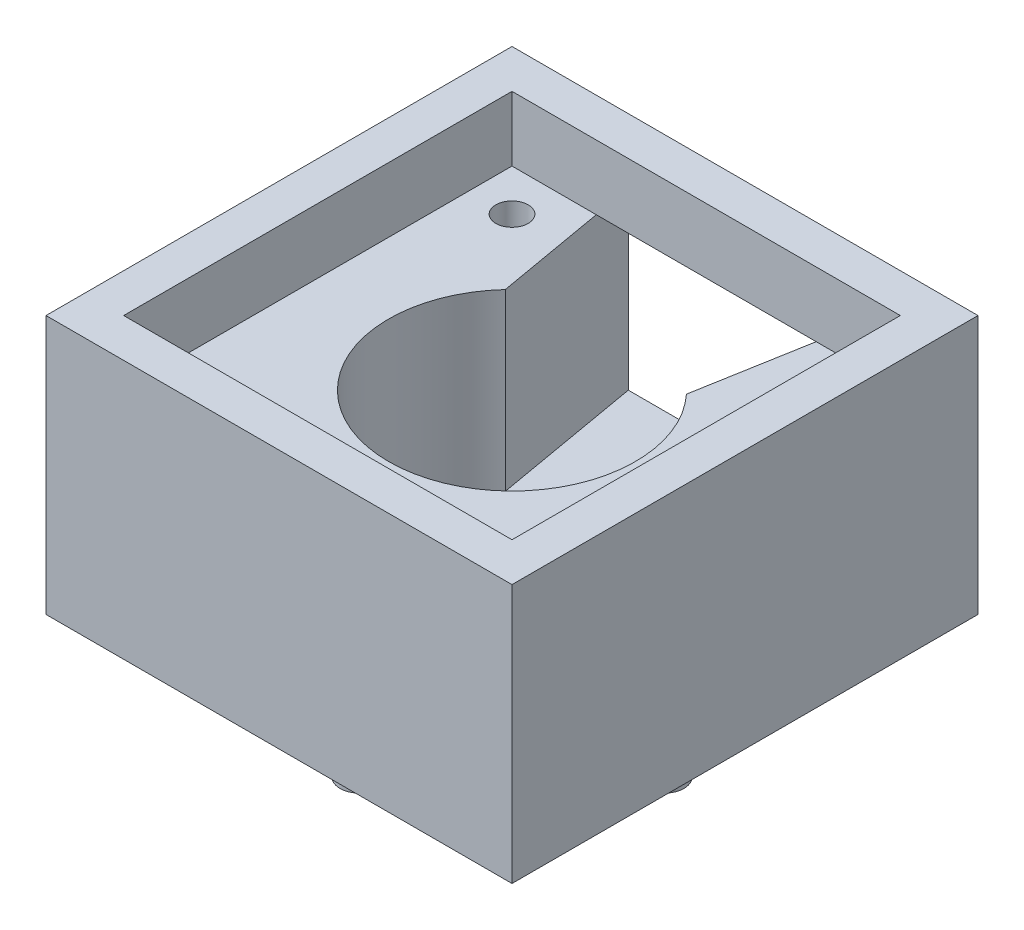
ISO-10303-21;
HEADER;
FILE_DESCRIPTION(('STEP AP214'),'2;1');
FILE_NAME('part.step','',(''),(''),'','','');
FILE_SCHEMA(('AUTOMOTIVE_DESIGN { 1 0 10303 214 1 1 1 1 }'));
ENDSEC;
DATA;
#1=APPLICATION_CONTEXT('core data for automotive mechanical design processes');
#2=APPLICATION_PROTOCOL_DEFINITION('international standard','automotive_design',2000,#1);
#3=PRODUCT_CONTEXT('',#1,'mechanical');
#4=PRODUCT('Part','Part','',(#3));
#5=PRODUCT_RELATED_PRODUCT_CATEGORY('part','',(#4));
#6=PRODUCT_DEFINITION_FORMATION('','',#4);
#7=PRODUCT_DEFINITION_CONTEXT('part definition',#1,'design');
#8=PRODUCT_DEFINITION('design','',#6,#7);
#9=PRODUCT_DEFINITION_SHAPE('','',#8);
#10=(LENGTH_UNIT() NAMED_UNIT(*) SI_UNIT(.MILLI.,.METRE.));
#11=(NAMED_UNIT(*) PLANE_ANGLE_UNIT() SI_UNIT($,.RADIAN.));
#12=(NAMED_UNIT(*) SI_UNIT($,.STERADIAN.) SOLID_ANGLE_UNIT());
#13=UNCERTAINTY_MEASURE_WITH_UNIT(LENGTH_MEASURE(1.E-05),#10,'distance_accuracy_value','');
#14=(GEOMETRIC_REPRESENTATION_CONTEXT(3) GLOBAL_UNCERTAINTY_ASSIGNED_CONTEXT((#13)) GLOBAL_UNIT_ASSIGNED_CONTEXT((#10,
#11,#12)) REPRESENTATION_CONTEXT('',''));
#15=CARTESIAN_POINT('',(0.,0.,0.));
#16=DIRECTION('',(0.,0.,1.));
#17=DIRECTION('',(1.,0.,0.));
#18=AXIS2_PLACEMENT_3D('',#15,#16,#17);
#19=CARTESIAN_POINT('',(0.,30.,0.));
#20=DIRECTION('',(0.,1.,0.));
#21=DIRECTION('',(0.,0.,1.));
#22=AXIS2_PLACEMENT_3D('',#19,#20,#21);
#23=PLANE('',#22);
#24=CARTESIAN_POINT('',(-23.57,30.,23.57));
#25=DIRECTION('',(0.,1.,0.));
#26=DIRECTION('',(0.,0.,1.));
#27=AXIS2_PLACEMENT_3D('',#24,#25,#26);
#28=CIRCLE('',#27,2.5);
#29=CARTESIAN_POINT('',(-23.57,30.,26.07));
#30=VERTEX_POINT('',#29);
#31=EDGE_CURVE('E169',#30,#30,#28,.T.);
#32=ORIENTED_EDGE('',*,*,#31,.F.);
#33=EDGE_LOOP('',(#32));
#34=FACE_BOUND('',#33,.T.);
#35=CARTESIAN_POINT('',(23.57,30.,-23.57));
#36=DIRECTION('',(0.,1.,0.));
#37=DIRECTION('',(0.,0.,1.));
#38=AXIS2_PLACEMENT_3D('',#35,#36,#37);
#39=CIRCLE('',#38,2.5);
#40=CARTESIAN_POINT('',(23.57,30.,-21.07));
#41=VERTEX_POINT('',#40);
#42=EDGE_CURVE('E170',#41,#41,#39,.T.);
#43=ORIENTED_EDGE('',*,*,#42,.F.);
#44=EDGE_LOOP('',(#43));
#45=FACE_BOUND('',#44,.T.);
#46=CARTESIAN_POINT('',(-23.57,30.,-23.57));
#47=DIRECTION('',(0.,1.,0.));
#48=DIRECTION('',(0.,0.,1.));
#49=AXIS2_PLACEMENT_3D('',#46,#47,#48);
#50=CIRCLE('',#49,2.5);
#51=CARTESIAN_POINT('',(-23.57,30.,-21.07));
#52=VERTEX_POINT('',#51);
#53=EDGE_CURVE('E157',#52,#52,#50,.T.);
#54=ORIENTED_EDGE('',*,*,#53,.F.);
#55=EDGE_LOOP('',(#54));
#56=FACE_BOUND('',#55,.T.);
#57=CARTESIAN_POINT('',(23.57,30.,23.57));
#58=DIRECTION('',(0.,1.,0.));
#59=DIRECTION('',(0.,0.,1.));
#60=AXIS2_PLACEMENT_3D('',#57,#58,#59);
#61=CIRCLE('',#60,2.5);
#62=CARTESIAN_POINT('',(23.57,30.,26.07));
#63=VERTEX_POINT('',#62);
#64=EDGE_CURVE('E173',#63,#63,#61,.T.);
#65=ORIENTED_EDGE('',*,*,#64,.F.);
#66=EDGE_LOOP('',(#65));
#67=FACE_BOUND('',#66,.T.);
#68=CARTESIAN_POINT('',(0.,30.,0.));
#69=DIRECTION('',(0.,1.,0.));
#70=DIRECTION('',(0.,0.,1.));
#71=AXIS2_PLACEMENT_3D('',#68,#69,#70);
#72=CIRCLE('',#71,19.075);
#73=CARTESIAN_POINT('',(-13.9955204399091,30.,-12.9607496934431));
#74=VERTEX_POINT('',#73);
#75=CARTESIAN_POINT('',(13.9955204399091,30.,-12.9607496934431));
#76=VERTEX_POINT('',#75);
#77=EDGE_CURVE('E151',#74,#76,#72,.T.);
#78=ORIENTED_EDGE('',*,*,#77,.F.);
#79=DIRECTION('',(-0.17249769651169,0.,-0.985009921116616));
#80=VECTOR('',#79,1.);
#81=CARTESIAN_POINT('',(-13.9955204399091,30.,-12.9607496934431));
#82=LINE('',#81,#80);
#83=CARTESIAN_POINT('',(-16.9794816824875,30.,-30.));
#84=VERTEX_POINT('',#83);
#85=EDGE_CURVE('E142',#74,#84,#82,.T.);
#86=ORIENTED_EDGE('',*,*,#85,.T.);
#87=DIRECTION('',(-1.,0.,0.));
#88=VECTOR('',#87,1.);
#89=CARTESIAN_POINT('',(-30.,30.,-30.));
#90=LINE('',#89,#88);
#91=CARTESIAN_POINT('',(-30.,30.,-30.));
#92=VERTEX_POINT('',#91);
#93=EDGE_CURVE('E187',#84,#92,#90,.T.);
#94=ORIENTED_EDGE('',*,*,#93,.T.);
#95=DIRECTION('',(0.,0.,1.));
#96=VECTOR('',#95,1.);
#97=CARTESIAN_POINT('',(-30.,30.,-30.));
#98=LINE('',#97,#96);
#99=CARTESIAN_POINT('',(-30.,30.,30.));
#100=VERTEX_POINT('',#99);
#101=EDGE_CURVE('E192',#92,#100,#98,.T.);
#102=ORIENTED_EDGE('',*,*,#101,.T.);
#103=DIRECTION('',(1.,0.,0.));
#104=VECTOR('',#103,1.);
#105=CARTESIAN_POINT('',(-30.,30.,30.));
#106=LINE('',#105,#104);
#107=CARTESIAN_POINT('',(30.,30.,30.));
#108=VERTEX_POINT('',#107);
#109=EDGE_CURVE('E195',#100,#108,#106,.T.);
#110=ORIENTED_EDGE('',*,*,#109,.T.);
#111=DIRECTION('',(0.,0.,-1.));
#112=VECTOR('',#111,1.);
#113=CARTESIAN_POINT('',(30.,30.,-30.));
#114=LINE('',#113,#112);
#115=CARTESIAN_POINT('',(30.,30.,-30.));
#116=VERTEX_POINT('',#115);
#117=EDGE_CURVE('E184',#108,#116,#114,.T.);
#118=ORIENTED_EDGE('',*,*,#117,.T.);
#119=CARTESIAN_POINT('',(17.0005490680199,30.,-30.));
#120=VERTEX_POINT('',#119);
#121=EDGE_CURVE('E189',#116,#120,#90,.T.);
#122=ORIENTED_EDGE('',*,*,#121,.T.);
#123=DIRECTION('',(0.173678954678895,0.,-0.984802325698739));
#124=VECTOR('',#123,1.);
#125=CARTESIAN_POINT('',(13.9955204399091,30.,-12.9607496934431));
#126=LINE('',#125,#124);
#127=EDGE_CURVE('E352',#76,#120,#126,.T.);
#128=ORIENTED_EDGE('',*,*,#127,.F.);
#129=EDGE_LOOP('',(#78,#86,#94,#102,#110,#118,#122,#128));
#130=FACE_BOUND('',#129,.T.);
#131=ADVANCED_FACE('F36',(#34,#45,#56,#67,#130),#23,.T.);
#132=CARTESIAN_POINT('',(0.,3.,0.));
#133=DIRECTION('',(0.,1.,0.));
#134=DIRECTION('',(0.,0.,1.));
#135=AXIS2_PLACEMENT_3D('',#132,#133,#134);
#136=CYLINDRICAL_SURFACE('',#135,19.075);
#137=DIRECTION('',(0.,1.,0.));
#138=VECTOR('',#137,1.);
#139=CARTESIAN_POINT('',(-13.9955204399091,3.,-12.9607496934431));
#140=LINE('',#139,#138);
#141=CARTESIAN_POINT('',(-13.9955204399091,3.,-12.9607496934431));
#142=VERTEX_POINT('',#141);
#143=EDGE_CURVE('E344',#142,#74,#140,.T.);
#144=ORIENTED_EDGE('',*,*,#143,.T.);
#145=ORIENTED_EDGE('',*,*,#77,.T.);
#146=DIRECTION('',(0.,1.,0.));
#147=VECTOR('',#146,1.);
#148=CARTESIAN_POINT('',(13.9955204399091,3.,-12.9607496934431));
#149=LINE('',#148,#147);
#150=CARTESIAN_POINT('',(13.9955204399091,3.,-12.9607496934431));
#151=VERTEX_POINT('',#150);
#152=EDGE_CURVE('E136',#151,#76,#149,.T.);
#153=ORIENTED_EDGE('',*,*,#152,.F.);
#154=CARTESIAN_POINT('',(0.,3.,0.));
#155=DIRECTION('',(0.,1.,0.));
#156=DIRECTION('',(0.,0.,1.));
#157=AXIS2_PLACEMENT_3D('',#154,#155,#156);
#158=CIRCLE('',#157,19.075);
#159=EDGE_CURVE('E149',#142,#151,#158,.T.);
#160=ORIENTED_EDGE('',*,*,#159,.F.);
#161=EDGE_LOOP('',(#144,#145,#153,#160));
#162=FACE_BOUND('',#161,.T.);
#163=ADVANCED_FACE('F148',(#162),#136,.F.);
#164=CARTESIAN_POINT('',(-36.,40.,-36.));
#165=DIRECTION('',(1.,0.,0.));
#166=DIRECTION('',(0.,0.,-1.));
#167=AXIS2_PLACEMENT_3D('',#164,#165,#166);
#168=PLANE('',#167);
#169=DIRECTION('',(0.,0.,1.));
#170=VECTOR('',#169,1.);
#171=CARTESIAN_POINT('',(-36.,0.,-36.));
#172=LINE('',#171,#170);
#173=CARTESIAN_POINT('',(-36.,0.,-36.));
#174=VERTEX_POINT('',#173);
#175=CARTESIAN_POINT('',(-36.,0.,36.));
#176=VERTEX_POINT('',#175);
#177=EDGE_CURVE('E210',#174,#176,#172,.T.);
#178=ORIENTED_EDGE('',*,*,#177,.T.);
#179=DIRECTION('',(0.,-1.,0.));
#180=VECTOR('',#179,1.);
#181=CARTESIAN_POINT('',(-36.,40.,36.));
#182=LINE('',#181,#180);
#183=CARTESIAN_POINT('',(-36.,40.,36.));
#184=VERTEX_POINT('',#183);
#185=EDGE_CURVE('E245',#184,#176,#182,.T.);
#186=ORIENTED_EDGE('',*,*,#185,.F.);
#187=DIRECTION('',(0.,0.,1.));
#188=VECTOR('',#187,1.);
#189=CARTESIAN_POINT('',(-36.,40.,-36.));
#190=LINE('',#189,#188);
#191=CARTESIAN_POINT('',(-36.,40.,-36.));
#192=VERTEX_POINT('',#191);
#193=EDGE_CURVE('E217',#192,#184,#190,.T.);
#194=ORIENTED_EDGE('',*,*,#193,.F.);
#195=DIRECTION('',(0.,-1.,0.));
#196=VECTOR('',#195,1.);
#197=CARTESIAN_POINT('',(-36.,40.,-36.));
#198=LINE('',#197,#196);
#199=EDGE_CURVE('E229',#192,#174,#198,.T.);
#200=ORIENTED_EDGE('',*,*,#199,.T.);
#201=EDGE_LOOP('',(#178,#186,#194,#200));
#202=FACE_BOUND('',#201,.T.);
#203=ADVANCED_FACE('F38',(#202),#168,.F.);
#204=CARTESIAN_POINT('',(-36.,40.,36.));
#205=DIRECTION('',(0.,0.,-1.));
#206=DIRECTION('',(-1.,0.,0.));
#207=AXIS2_PLACEMENT_3D('',#204,#205,#206);
#208=PLANE('',#207);
#209=DIRECTION('',(1.,0.,0.));
#210=VECTOR('',#209,1.);
#211=CARTESIAN_POINT('',(-36.,0.,36.));
#212=LINE('',#211,#210);
#213=CARTESIAN_POINT('',(36.,0.,36.));
#214=VERTEX_POINT('',#213);
#215=EDGE_CURVE('E232',#176,#214,#212,.T.);
#216=ORIENTED_EDGE('',*,*,#215,.T.);
#217=DIRECTION('',(0.,-1.,0.));
#218=VECTOR('',#217,1.);
#219=CARTESIAN_POINT('',(36.,40.,36.));
#220=LINE('',#219,#218);
#221=CARTESIAN_POINT('',(36.,40.,36.));
#222=VERTEX_POINT('',#221);
#223=EDGE_CURVE('E243',#222,#214,#220,.T.);
#224=ORIENTED_EDGE('',*,*,#223,.F.);
#225=DIRECTION('',(1.,0.,0.));
#226=VECTOR('',#225,1.);
#227=CARTESIAN_POINT('',(-36.,40.,36.));
#228=LINE('',#227,#226);
#229=EDGE_CURVE('E220',#184,#222,#228,.T.);
#230=ORIENTED_EDGE('',*,*,#229,.F.);
#231=ORIENTED_EDGE('',*,*,#185,.T.);
#232=EDGE_LOOP('',(#216,#224,#230,#231));
#233=FACE_BOUND('',#232,.T.);
#234=ADVANCED_FACE('F286',(#233),#208,.F.);
#235=CARTESIAN_POINT('',(36.,40.,-36.));
#236=DIRECTION('',(1.,0.,0.));
#237=DIRECTION('',(0.,0.,-1.));
#238=AXIS2_PLACEMENT_3D('',#235,#236,#237);
#239=PLANE('',#238);
#240=DIRECTION('',(0.,0.,1.));
#241=VECTOR('',#240,1.);
#242=CARTESIAN_POINT('',(36.,0.,-36.));
#243=LINE('',#242,#241);
#244=CARTESIAN_POINT('',(36.,0.,-36.));
#245=VERTEX_POINT('',#244);
#246=EDGE_CURVE('E235',#245,#214,#243,.T.);
#247=ORIENTED_EDGE('',*,*,#246,.F.);
#248=DIRECTION('',(0.,-1.,0.));
#249=VECTOR('',#248,1.);
#250=CARTESIAN_POINT('',(36.,40.,-36.));
#251=LINE('',#250,#249);
#252=CARTESIAN_POINT('',(36.,40.,-36.));
#253=VERTEX_POINT('',#252);
#254=EDGE_CURVE('E241',#253,#245,#251,.T.);
#255=ORIENTED_EDGE('',*,*,#254,.F.);
#256=DIRECTION('',(0.,0.,1.));
#257=VECTOR('',#256,1.);
#258=CARTESIAN_POINT('',(36.,40.,-36.));
#259=LINE('',#258,#257);
#260=EDGE_CURVE('E223',#253,#222,#259,.T.);
#261=ORIENTED_EDGE('',*,*,#260,.T.);
#262=ORIENTED_EDGE('',*,*,#223,.T.);
#263=EDGE_LOOP('',(#247,#255,#261,#262));
#264=FACE_BOUND('',#263,.T.);
#265=ADVANCED_FACE('F283',(#264),#239,.T.);
#266=CARTESIAN_POINT('',(-36.,40.,-36.));
#267=DIRECTION('',(0.,0.,-1.));
#268=DIRECTION('',(-1.,0.,0.));
#269=AXIS2_PLACEMENT_3D('',#266,#267,#268);
#270=PLANE('',#269);
#271=DIRECTION('',(-1.,0.,0.));
#272=VECTOR('',#271,1.);
#273=CARTESIAN_POINT('',(18.0587042945868,3.,-36.));
#274=LINE('',#273,#272);
#275=CARTESIAN_POINT('',(18.0587042945868,3.,-36.));
#276=VERTEX_POINT('',#275);
#277=CARTESIAN_POINT('',(-18.0302184891755,3.,-36.));
#278=VERTEX_POINT('',#277);
#279=EDGE_CURVE('E141',#276,#278,#274,.T.);
#280=ORIENTED_EDGE('',*,*,#279,.F.);
#281=DIRECTION('',(0.,1.,0.));
#282=VECTOR('',#281,1.);
#283=CARTESIAN_POINT('',(18.0587042945868,3.,-36.));
#284=LINE('',#283,#282);
#285=CARTESIAN_POINT('',(18.0587042945868,30.,-36.));
#286=VERTEX_POINT('',#285);
#287=EDGE_CURVE('E139',#276,#286,#284,.T.);
#288=ORIENTED_EDGE('',*,*,#287,.T.);
#289=DIRECTION('',(-1.,0.,0.));
#290=VECTOR('',#289,1.);
#291=CARTESIAN_POINT('',(18.0587042945868,30.,-36.));
#292=LINE('',#291,#290);
#293=CARTESIAN_POINT('',(-18.0302184891755,30.,-36.));
#294=VERTEX_POINT('',#293);
#295=EDGE_CURVE('E340',#286,#294,#292,.T.);
#296=ORIENTED_EDGE('',*,*,#295,.T.);
#297=DIRECTION('',(0.,1.,0.));
#298=VECTOR('',#297,1.);
#299=CARTESIAN_POINT('',(-18.0302184891755,3.,-36.));
#300=LINE('',#299,#298);
#301=EDGE_CURVE('E51',#278,#294,#300,.T.);
#302=ORIENTED_EDGE('',*,*,#301,.F.);
#303=EDGE_LOOP('',(#280,#288,#296,#302));
#304=FACE_BOUND('',#303,.T.);
#305=DIRECTION('',(1.,0.,0.));
#306=VECTOR('',#305,1.);
#307=CARTESIAN_POINT('',(-36.,0.,-36.));
#308=LINE('',#307,#306);
#309=EDGE_CURVE('E221',#174,#245,#308,.T.);
#310=ORIENTED_EDGE('',*,*,#309,.F.);
#311=ORIENTED_EDGE('',*,*,#199,.F.);
#312=DIRECTION('',(1.,0.,0.));
#313=VECTOR('',#312,1.);
#314=CARTESIAN_POINT('',(-36.,40.,-36.));
#315=LINE('',#314,#313);
#316=EDGE_CURVE('E226',#192,#253,#315,.T.);
#317=ORIENTED_EDGE('',*,*,#316,.T.);
#318=ORIENTED_EDGE('',*,*,#254,.T.);
#319=EDGE_LOOP('',(#310,#311,#317,#318));
#320=FACE_BOUND('',#319,.T.);
#321=ADVANCED_FACE('F277',(#304,#320),#270,.T.);
#322=CARTESIAN_POINT('',(0.,40.,0.));
#323=DIRECTION('',(0.,1.,0.));
#324=DIRECTION('',(0.,0.,1.));
#325=AXIS2_PLACEMENT_3D('',#322,#323,#324);
#326=PLANE('',#325);
#327=DIRECTION('',(0.,0.,-1.));
#328=VECTOR('',#327,1.);
#329=CARTESIAN_POINT('',(30.,40.,-30.));
#330=LINE('',#329,#328);
#331=CARTESIAN_POINT('',(30.,40.,30.));
#332=VERTEX_POINT('',#331);
#333=CARTESIAN_POINT('',(30.,40.,-30.));
#334=VERTEX_POINT('',#333);
#335=EDGE_CURVE('E183',#332,#334,#330,.T.);
#336=ORIENTED_EDGE('',*,*,#335,.F.);
#337=DIRECTION('',(1.,0.,0.));
#338=VECTOR('',#337,1.);
#339=CARTESIAN_POINT('',(-30.,40.,30.));
#340=LINE('',#339,#338);
#341=CARTESIAN_POINT('',(-30.,40.,30.));
#342=VERTEX_POINT('',#341);
#343=EDGE_CURVE('E188',#342,#332,#340,.T.);
#344=ORIENTED_EDGE('',*,*,#343,.F.);
#345=DIRECTION('',(0.,0.,1.));
#346=VECTOR('',#345,1.);
#347=CARTESIAN_POINT('',(-30.,40.,-30.));
#348=LINE('',#347,#346);
#349=CARTESIAN_POINT('',(-30.,40.,-30.));
#350=VERTEX_POINT('',#349);
#351=EDGE_CURVE('E203',#350,#342,#348,.T.);
#352=ORIENTED_EDGE('',*,*,#351,.F.);
#353=DIRECTION('',(-1.,0.,0.));
#354=VECTOR('',#353,1.);
#355=CARTESIAN_POINT('',(-30.,40.,-30.));
#356=LINE('',#355,#354);
#357=EDGE_CURVE('E200',#334,#350,#356,.T.);
#358=ORIENTED_EDGE('',*,*,#357,.F.);
#359=EDGE_LOOP('',(#336,#344,#352,#358));
#360=FACE_BOUND('',#359,.T.);
#361=ORIENTED_EDGE('',*,*,#193,.T.);
#362=ORIENTED_EDGE('',*,*,#229,.T.);
#363=ORIENTED_EDGE('',*,*,#260,.F.);
#364=ORIENTED_EDGE('',*,*,#316,.F.);
#365=EDGE_LOOP('',(#361,#362,#363,#364));
#366=FACE_BOUND('',#365,.T.);
#367=ADVANCED_FACE('F259',(#360,#366),#326,.T.);
#368=CARTESIAN_POINT('',(0.,0.,0.));
#369=DIRECTION('',(0.,1.,0.));
#370=DIRECTION('',(0.,0.,1.));
#371=AXIS2_PLACEMENT_3D('',#368,#369,#370);
#372=PLANE('',#371);
#373=CARTESIAN_POINT('',(0.,0.,23.57));
#374=DIRECTION('',(0.,1.,0.));
#375=DIRECTION('',(0.,0.,1.));
#376=AXIS2_PLACEMENT_3D('',#373,#374,#375);
#377=CIRCLE('',#376,3.);
#378=CARTESIAN_POINT('',(0.,0.,26.57));
#379=VERTEX_POINT('',#378);
#380=EDGE_CURVE('E11',#379,#379,#377,.F.);
#381=ORIENTED_EDGE('',*,*,#380,.F.);
#382=EDGE_LOOP('',(#381));
#383=FACE_BOUND('',#382,.T.);
#384=CARTESIAN_POINT('',(-23.57,0.,0.));
#385=DIRECTION('',(0.,1.,0.));
#386=DIRECTION('',(0.,0.,1.));
#387=AXIS2_PLACEMENT_3D('',#384,#385,#386);
#388=CIRCLE('',#387,3.);
#389=CARTESIAN_POINT('',(-23.57,0.,2.99999999999999));
#390=VERTEX_POINT('',#389);
#391=EDGE_CURVE('E44',#390,#390,#388,.F.);
#392=ORIENTED_EDGE('',*,*,#391,.F.);
#393=EDGE_LOOP('',(#392));
#394=FACE_BOUND('',#393,.T.);
#395=CARTESIAN_POINT('',(23.57,0.,0.));
#396=DIRECTION('',(0.,1.,0.));
#397=DIRECTION('',(0.,0.,1.));
#398=AXIS2_PLACEMENT_3D('',#395,#396,#397);
#399=CIRCLE('',#398,3.);
#400=CARTESIAN_POINT('',(23.57,0.,2.99999999999999));
#401=VERTEX_POINT('',#400);
#402=EDGE_CURVE('E248',#401,#401,#399,.F.);
#403=ORIENTED_EDGE('',*,*,#402,.F.);
#404=EDGE_LOOP('',(#403));
#405=FACE_BOUND('',#404,.T.);
#406=CARTESIAN_POINT('',(-23.57,0.,23.57));
#407=DIRECTION('',(0.,1.,0.));
#408=DIRECTION('',(0.,0.,1.));
#409=AXIS2_PLACEMENT_3D('',#406,#407,#408);
#410=CIRCLE('',#409,2.5);
#411=CARTESIAN_POINT('',(-23.57,0.,26.07));
#412=VERTEX_POINT('',#411);
#413=EDGE_CURVE('E166',#412,#412,#410,.F.);
#414=ORIENTED_EDGE('',*,*,#413,.F.);
#415=EDGE_LOOP('',(#414));
#416=FACE_BOUND('',#415,.T.);
#417=CARTESIAN_POINT('',(23.57,0.,-23.57));
#418=DIRECTION('',(0.,1.,0.));
#419=DIRECTION('',(0.,0.,1.));
#420=AXIS2_PLACEMENT_3D('',#417,#418,#419);
#421=CIRCLE('',#420,2.5);
#422=CARTESIAN_POINT('',(23.57,0.,-21.07));
#423=VERTEX_POINT('',#422);
#424=EDGE_CURVE('E165',#423,#423,#421,.F.);
#425=ORIENTED_EDGE('',*,*,#424,.F.);
#426=EDGE_LOOP('',(#425));
#427=FACE_BOUND('',#426,.T.);
#428=CARTESIAN_POINT('',(-23.57,0.,-23.57));
#429=DIRECTION('',(0.,1.,0.));
#430=DIRECTION('',(0.,0.,1.));
#431=AXIS2_PLACEMENT_3D('',#428,#429,#430);
#432=CIRCLE('',#431,2.5);
#433=CARTESIAN_POINT('',(-23.57,0.,-21.07));
#434=VERTEX_POINT('',#433);
#435=EDGE_CURVE('E154',#434,#434,#432,.F.);
#436=ORIENTED_EDGE('',*,*,#435,.F.);
#437=EDGE_LOOP('',(#436));
#438=FACE_BOUND('',#437,.T.);
#439=CARTESIAN_POINT('',(23.57,0.,23.57));
#440=DIRECTION('',(0.,1.,0.));
#441=DIRECTION('',(0.,0.,1.));
#442=AXIS2_PLACEMENT_3D('',#439,#440,#441);
#443=CIRCLE('',#442,2.5);
#444=CARTESIAN_POINT('',(23.57,0.,26.07));
#445=VERTEX_POINT('',#444);
#446=EDGE_CURVE('E180',#445,#445,#443,.F.);
#447=ORIENTED_EDGE('',*,*,#446,.F.);
#448=EDGE_LOOP('',(#447));
#449=FACE_BOUND('',#448,.T.);
#450=ORIENTED_EDGE('',*,*,#177,.F.);
#451=ORIENTED_EDGE('',*,*,#309,.T.);
#452=ORIENTED_EDGE('',*,*,#246,.T.);
#453=ORIENTED_EDGE('',*,*,#215,.F.);
#454=EDGE_LOOP('',(#450,#451,#452,#453));
#455=FACE_BOUND('',#454,.T.);
#456=ADVANCED_FACE('F255',(#383,#394,#405,#416,#427,#438,#449,#455),#372,.F.);
#457=CARTESIAN_POINT('',(30.,30.,-30.));
#458=DIRECTION('',(1.,0.,0.));
#459=DIRECTION('',(0.,0.,-1.));
#460=AXIS2_PLACEMENT_3D('',#457,#458,#459);
#461=PLANE('',#460);
#462=ORIENTED_EDGE('',*,*,#335,.T.);
#463=DIRECTION('',(0.,1.,0.));
#464=VECTOR('',#463,1.);
#465=CARTESIAN_POINT('',(30.,30.,-30.));
#466=LINE('',#465,#464);
#467=EDGE_CURVE('E198',#116,#334,#466,.T.);
#468=ORIENTED_EDGE('',*,*,#467,.F.);
#469=ORIENTED_EDGE('',*,*,#117,.F.);
#470=DIRECTION('',(0.,1.,0.));
#471=VECTOR('',#470,1.);
#472=CARTESIAN_POINT('',(30.,30.,30.));
#473=LINE('',#472,#471);
#474=EDGE_CURVE('E208',#108,#332,#473,.T.);
#475=ORIENTED_EDGE('',*,*,#474,.T.);
#476=EDGE_LOOP('',(#462,#468,#469,#475));
#477=FACE_BOUND('',#476,.T.);
#478=ADVANCED_FACE('F258',(#477),#461,.F.);
#479=CARTESIAN_POINT('',(-30.,30.,30.));
#480=DIRECTION('',(0.,0.,1.));
#481=DIRECTION('',(1.,0.,0.));
#482=AXIS2_PLACEMENT_3D('',#479,#480,#481);
#483=PLANE('',#482);
#484=ORIENTED_EDGE('',*,*,#343,.T.);
#485=ORIENTED_EDGE('',*,*,#474,.F.);
#486=ORIENTED_EDGE('',*,*,#109,.F.);
#487=DIRECTION('',(0.,1.,0.));
#488=VECTOR('',#487,1.);
#489=CARTESIAN_POINT('',(-30.,30.,30.));
#490=LINE('',#489,#488);
#491=EDGE_CURVE('E211',#100,#342,#490,.T.);
#492=ORIENTED_EDGE('',*,*,#491,.T.);
#493=EDGE_LOOP('',(#484,#485,#486,#492));
#494=FACE_BOUND('',#493,.T.);
#495=ADVANCED_FACE('F311',(#494),#483,.F.);
#496=CARTESIAN_POINT('',(-30.,30.,-30.));
#497=DIRECTION('',(-1.,0.,0.));
#498=DIRECTION('',(0.,0.,1.));
#499=AXIS2_PLACEMENT_3D('',#496,#497,#498);
#500=PLANE('',#499);
#501=ORIENTED_EDGE('',*,*,#351,.T.);
#502=ORIENTED_EDGE('',*,*,#491,.F.);
#503=ORIENTED_EDGE('',*,*,#101,.F.);
#504=DIRECTION('',(0.,1.,0.));
#505=VECTOR('',#504,1.);
#506=CARTESIAN_POINT('',(-30.,30.,-30.));
#507=LINE('',#506,#505);
#508=EDGE_CURVE('E213',#92,#350,#507,.T.);
#509=ORIENTED_EDGE('',*,*,#508,.T.);
#510=EDGE_LOOP('',(#501,#502,#503,#509));
#511=FACE_BOUND('',#510,.T.);
#512=ADVANCED_FACE('F314',(#511),#500,.F.);
#513=CARTESIAN_POINT('',(-30.,30.,-30.));
#514=DIRECTION('',(0.,0.,-1.));
#515=DIRECTION('',(-1.,0.,0.));
#516=AXIS2_PLACEMENT_3D('',#513,#514,#515);
#517=PLANE('',#516);
#518=ORIENTED_EDGE('',*,*,#357,.T.);
#519=ORIENTED_EDGE('',*,*,#508,.F.);
#520=ORIENTED_EDGE('',*,*,#93,.F.);
#521=DIRECTION('',(-1.,0.,0.));
#522=VECTOR('',#521,1.);
#523=CARTESIAN_POINT('',(-30.,30.,-30.));
#524=LINE('',#523,#522);
#525=EDGE_CURVE('E159',#120,#84,#524,.T.);
#526=ORIENTED_EDGE('',*,*,#525,.F.);
#527=ORIENTED_EDGE('',*,*,#121,.F.);
#528=ORIENTED_EDGE('',*,*,#467,.T.);
#529=EDGE_LOOP('',(#518,#519,#520,#526,#527,#528));
#530=FACE_BOUND('',#529,.T.);
#531=ADVANCED_FACE('F318',(#530),#517,.F.);
#532=CARTESIAN_POINT('',(23.57,-7.07106781186548,23.57));
#533=DIRECTION('',(0.,1.,0.));
#534=DIRECTION('',(0.,0.,1.));
#535=AXIS2_PLACEMENT_3D('',#532,#533,#534);
#536=CYLINDRICAL_SURFACE('',#535,2.5);
#537=ORIENTED_EDGE('',*,*,#446,.T.);
#538=EDGE_LOOP('',(#537));
#539=FACE_BOUND('',#538,.T.);
#540=ORIENTED_EDGE('',*,*,#64,.T.);
#541=EDGE_LOOP('',(#540));
#542=FACE_BOUND('',#541,.T.);
#543=ADVANCED_FACE('F309',(#539,#542),#536,.F.);
#544=CARTESIAN_POINT('',(-23.57,-7.07106781186548,-23.57));
#545=DIRECTION('',(0.,1.,0.));
#546=DIRECTION('',(0.,0.,1.));
#547=AXIS2_PLACEMENT_3D('',#544,#545,#546);
#548=CYLINDRICAL_SURFACE('',#547,2.5);
#549=ORIENTED_EDGE('',*,*,#435,.T.);
#550=EDGE_LOOP('',(#549));
#551=FACE_BOUND('',#550,.T.);
#552=ORIENTED_EDGE('',*,*,#53,.T.);
#553=EDGE_LOOP('',(#552));
#554=FACE_BOUND('',#553,.T.);
#555=ADVANCED_FACE('F404',(#551,#554),#548,.F.);
#556=CARTESIAN_POINT('',(23.57,-7.07106781186548,-23.57));
#557=DIRECTION('',(0.,1.,0.));
#558=DIRECTION('',(0.,0.,1.));
#559=AXIS2_PLACEMENT_3D('',#556,#557,#558);
#560=CYLINDRICAL_SURFACE('',#559,2.5);
#561=ORIENTED_EDGE('',*,*,#424,.T.);
#562=EDGE_LOOP('',(#561));
#563=FACE_BOUND('',#562,.T.);
#564=ORIENTED_EDGE('',*,*,#42,.T.);
#565=EDGE_LOOP('',(#564));
#566=FACE_BOUND('',#565,.T.);
#567=ADVANCED_FACE('F407',(#563,#566),#560,.F.);
#568=CARTESIAN_POINT('',(-23.57,-7.07106781186548,23.57));
#569=DIRECTION('',(0.,1.,0.));
#570=DIRECTION('',(0.,0.,1.));
#571=AXIS2_PLACEMENT_3D('',#568,#569,#570);
#572=CYLINDRICAL_SURFACE('',#571,2.5);
#573=ORIENTED_EDGE('',*,*,#413,.T.);
#574=EDGE_LOOP('',(#573));
#575=FACE_BOUND('',#574,.T.);
#576=ORIENTED_EDGE('',*,*,#31,.T.);
#577=EDGE_LOOP('',(#576));
#578=FACE_BOUND('',#577,.T.);
#579=ADVANCED_FACE('F402',(#575,#578),#572,.F.);
#580=CARTESIAN_POINT('',(0.,3.,0.));
#581=DIRECTION('',(0.,1.,0.));
#582=DIRECTION('',(0.,0.,1.));
#583=AXIS2_PLACEMENT_3D('',#580,#581,#582);
#584=PLANE('',#583);
#585=ORIENTED_EDGE('',*,*,#159,.T.);
#586=DIRECTION('',(0.173678954678895,0.,-0.984802325698739));
#587=VECTOR('',#586,1.);
#588=CARTESIAN_POINT('',(13.9955204399091,3.,-12.9607496934431));
#589=LINE('',#588,#587);
#590=EDGE_CURVE('E132',#151,#276,#589,.T.);
#591=ORIENTED_EDGE('',*,*,#590,.T.);
#592=ORIENTED_EDGE('',*,*,#279,.T.);
#593=DIRECTION('',(-0.17249769651169,0.,-0.985009921116616));
#594=VECTOR('',#593,1.);
#595=CARTESIAN_POINT('',(-13.9955204399091,3.,-12.9607496934431));
#596=LINE('',#595,#594);
#597=EDGE_CURVE('E58',#142,#278,#596,.T.);
#598=ORIENTED_EDGE('',*,*,#597,.F.);
#599=EDGE_LOOP('',(#585,#591,#592,#598));
#600=FACE_BOUND('',#599,.T.);
#601=ADVANCED_FACE('F153',(#600),#584,.T.);
#602=CARTESIAN_POINT('',(0.,30.,0.));
#603=DIRECTION('',(0.,-1.,0.));
#604=DIRECTION('',(0.,0.,-1.));
#605=AXIS2_PLACEMENT_3D('',#602,#603,#604);
#606=PLANE('',#605);
#607=ORIENTED_EDGE('',*,*,#525,.T.);
#608=EDGE_CURVE('E338',#84,#294,#82,.T.);
#609=ORIENTED_EDGE('',*,*,#608,.T.);
#610=ORIENTED_EDGE('',*,*,#295,.F.);
#611=EDGE_CURVE('E353',#120,#286,#126,.T.);
#612=ORIENTED_EDGE('',*,*,#611,.F.);
#613=EDGE_LOOP('',(#607,#609,#610,#612));
#614=FACE_BOUND('',#613,.T.);
#615=ADVANCED_FACE('F392',(#614),#606,.T.);
#616=CARTESIAN_POINT('',(-13.9955204399091,3.,-12.9607496934431));
#617=DIRECTION('',(0.985009921116615,0.,-0.17249769651169));
#618=DIRECTION('',(-0.17249769651169,0.,-0.985009921116616));
#619=AXIS2_PLACEMENT_3D('',#616,#617,#618);
#620=PLANE('',#619);
#621=ORIENTED_EDGE('',*,*,#85,.F.);
#622=ORIENTED_EDGE('',*,*,#143,.F.);
#623=ORIENTED_EDGE('',*,*,#597,.T.);
#624=ORIENTED_EDGE('',*,*,#301,.T.);
#625=ORIENTED_EDGE('',*,*,#608,.F.);
#626=EDGE_LOOP('',(#621,#622,#623,#624,#625));
#627=FACE_BOUND('',#626,.T.);
#628=ADVANCED_FACE('F395',(#627),#620,.T.);
#629=CARTESIAN_POINT('',(13.9955204399091,3.,-12.9607496934431));
#630=DIRECTION('',(0.98480232569874,0.,0.173678954678895));
#631=DIRECTION('',(0.173678954678895,0.,-0.98480232569874));
#632=AXIS2_PLACEMENT_3D('',#629,#630,#631);
#633=PLANE('',#632);
#634=ORIENTED_EDGE('',*,*,#127,.T.);
#635=ORIENTED_EDGE('',*,*,#611,.T.);
#636=ORIENTED_EDGE('',*,*,#287,.F.);
#637=ORIENTED_EDGE('',*,*,#590,.F.);
#638=ORIENTED_EDGE('',*,*,#152,.T.);
#639=EDGE_LOOP('',(#634,#635,#636,#637,#638));
#640=FACE_BOUND('',#639,.T.);
#641=ADVANCED_FACE('F135',(#640),#633,.F.);
#642=CARTESIAN_POINT('',(23.57,-10.,0.));
#643=DIRECTION('',(0.,1.,0.));
#644=DIRECTION('',(0.,0.,1.));
#645=AXIS2_PLACEMENT_3D('',#642,#643,#644);
#646=CYLINDRICAL_SURFACE('',#645,3.);
#647=CARTESIAN_POINT('',(23.57,-10.,0.));
#648=DIRECTION('',(0.,-1.,0.));
#649=DIRECTION('',(0.,0.,-1.));
#650=AXIS2_PLACEMENT_3D('',#647,#648,#649);
#651=CIRCLE('',#650,3.);
#652=CARTESIAN_POINT('',(23.57,-10.,-3.00000000000001));
#653=VERTEX_POINT('',#652);
#654=EDGE_CURVE('E354',#653,#653,#651,.T.);
#655=ORIENTED_EDGE('',*,*,#654,.F.);
#656=EDGE_LOOP('',(#655));
#657=FACE_BOUND('',#656,.T.);
#658=ORIENTED_EDGE('',*,*,#402,.T.);
#659=EDGE_LOOP('',(#658));
#660=FACE_BOUND('',#659,.T.);
#661=ADVANCED_FACE('F388',(#657,#660),#646,.T.);
#662=CARTESIAN_POINT('',(23.57,-10.,0.));
#663=DIRECTION('',(0.,-1.,0.));
#664=DIRECTION('',(0.,0.,-1.));
#665=AXIS2_PLACEMENT_3D('',#662,#663,#664);
#666=PLANE('',#665);
#667=ORIENTED_EDGE('',*,*,#654,.T.);
#668=EDGE_LOOP('',(#667));
#669=FACE_BOUND('',#668,.T.);
#670=ADVANCED_FACE('F383',(#669),#666,.T.);
#671=CARTESIAN_POINT('',(-23.57,-10.,0.));
#672=DIRECTION('',(0.,1.,0.));
#673=DIRECTION('',(0.,0.,1.));
#674=AXIS2_PLACEMENT_3D('',#671,#672,#673);
#675=CYLINDRICAL_SURFACE('',#674,3.);
#676=CARTESIAN_POINT('',(-23.57,-10.,0.));
#677=DIRECTION('',(0.,-1.,0.));
#678=DIRECTION('',(0.,0.,-1.));
#679=AXIS2_PLACEMENT_3D('',#676,#677,#678);
#680=CIRCLE('',#679,3.);
#681=CARTESIAN_POINT('',(-23.57,-10.,-3.00000000000001));
#682=VERTEX_POINT('',#681);
#683=EDGE_CURVE('E356',#682,#682,#680,.T.);
#684=ORIENTED_EDGE('',*,*,#683,.F.);
#685=EDGE_LOOP('',(#684));
#686=FACE_BOUND('',#685,.T.);
#687=ORIENTED_EDGE('',*,*,#391,.T.);
#688=EDGE_LOOP('',(#687));
#689=FACE_BOUND('',#688,.T.);
#690=ADVANCED_FACE('F253',(#686,#689),#675,.T.);
#691=CARTESIAN_POINT('',(-23.57,-10.,0.));
#692=DIRECTION('',(0.,-1.,0.));
#693=DIRECTION('',(0.,0.,-1.));
#694=AXIS2_PLACEMENT_3D('',#691,#692,#693);
#695=PLANE('',#694);
#696=ORIENTED_EDGE('',*,*,#683,.T.);
#697=EDGE_LOOP('',(#696));
#698=FACE_BOUND('',#697,.T.);
#699=ADVANCED_FACE('F371',(#698),#695,.T.);
#700=CARTESIAN_POINT('',(0.,-10.,23.57));
#701=DIRECTION('',(0.,1.,0.));
#702=DIRECTION('',(0.,0.,1.));
#703=AXIS2_PLACEMENT_3D('',#700,#701,#702);
#704=CYLINDRICAL_SURFACE('',#703,3.);
#705=CARTESIAN_POINT('',(0.,-10.,23.57));
#706=DIRECTION('',(0.,-1.,0.));
#707=DIRECTION('',(0.,0.,-1.));
#708=AXIS2_PLACEMENT_3D('',#705,#706,#707);
#709=CIRCLE('',#708,3.);
#710=CARTESIAN_POINT('',(0.,-10.,20.57));
#711=VERTEX_POINT('',#710);
#712=EDGE_CURVE('E360',#711,#711,#709,.T.);
#713=ORIENTED_EDGE('',*,*,#712,.F.);
#714=EDGE_LOOP('',(#713));
#715=FACE_BOUND('',#714,.T.);
#716=ORIENTED_EDGE('',*,*,#380,.T.);
#717=EDGE_LOOP('',(#716));
#718=FACE_BOUND('',#717,.T.);
#719=ADVANCED_FACE('F368',(#715,#718),#704,.T.);
#720=CARTESIAN_POINT('',(0.,-10.,23.57));
#721=DIRECTION('',(0.,-1.,0.));
#722=DIRECTION('',(0.,0.,-1.));
#723=AXIS2_PLACEMENT_3D('',#720,#721,#722);
#724=PLANE('',#723);
#725=ORIENTED_EDGE('',*,*,#712,.T.);
#726=EDGE_LOOP('',(#725));
#727=FACE_BOUND('',#726,.T.);
#728=ADVANCED_FACE('F366',(#727),#724,.T.);
#729=CLOSED_SHELL('',(#131,#163,#203,#234,#265,#321,#367,#456,#478,#495,#512,#531,#543,#555,
#567,#579,#601,#615,#628,#641,#661,#670,#690,#699,#719,#728));
#730=MANIFOLD_SOLID_BREP('B2',#729);
#731=ADVANCED_BREP_SHAPE_REPRESENTATION('',(#18,#730),#14);
#732=SHAPE_DEFINITION_REPRESENTATION(#9,#731);
ENDSEC;
END-ISO-10303-21;
